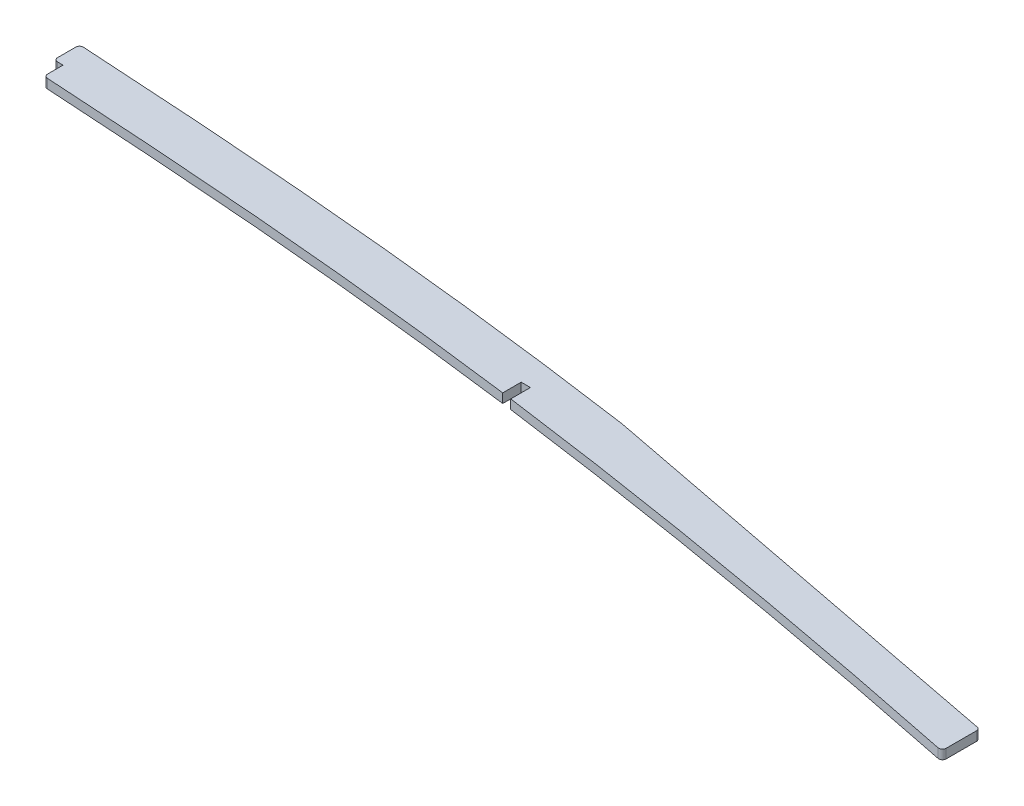
ISO-10303-21;
HEADER;
FILE_DESCRIPTION(('STEP AP214'),'2;1');
FILE_NAME('part.step','',(''),(''),'','','');
FILE_SCHEMA(('AUTOMOTIVE_DESIGN { 1 0 10303 214 1 1 1 1 }'));
ENDSEC;
DATA;
#1=APPLICATION_CONTEXT('core data for automotive mechanical design processes');
#2=APPLICATION_PROTOCOL_DEFINITION('international standard','automotive_design',2000,#1);
#3=PRODUCT_CONTEXT('',#1,'mechanical');
#4=PRODUCT('Part','Part','',(#3));
#5=PRODUCT_RELATED_PRODUCT_CATEGORY('part','',(#4));
#6=PRODUCT_DEFINITION_FORMATION('','',#4);
#7=PRODUCT_DEFINITION_CONTEXT('part definition',#1,'design');
#8=PRODUCT_DEFINITION('design','',#6,#7);
#9=PRODUCT_DEFINITION_SHAPE('','',#8);
#10=(LENGTH_UNIT() NAMED_UNIT(*) SI_UNIT(.MILLI.,.METRE.));
#11=(NAMED_UNIT(*) PLANE_ANGLE_UNIT() SI_UNIT($,.RADIAN.));
#12=(NAMED_UNIT(*) SI_UNIT($,.STERADIAN.) SOLID_ANGLE_UNIT());
#13=UNCERTAINTY_MEASURE_WITH_UNIT(LENGTH_MEASURE(1.E-05),#10,'distance_accuracy_value','');
#14=(GEOMETRIC_REPRESENTATION_CONTEXT(3) GLOBAL_UNCERTAINTY_ASSIGNED_CONTEXT((#13)) GLOBAL_UNIT_ASSIGNED_CONTEXT((#10,
#11,#12)) REPRESENTATION_CONTEXT('',''));
#15=CARTESIAN_POINT('',(0.,0.,0.));
#16=DIRECTION('',(0.,0.,1.));
#17=DIRECTION('',(1.,0.,0.));
#18=AXIS2_PLACEMENT_3D('',#15,#16,#17);
#19=CARTESIAN_POINT('',(2125.00064017427,1.5875,-94.4800369448474));
#20=CARTESIAN_POINT('',(2149.04351205278,1.5875,-93.497408198186));
#21=CARTESIAN_POINT('',(2173.08465693507,1.5875,-92.4714303186568));
#22=CARTESIAN_POINT('',(2221.16051111618,1.5875,-90.2825451342161));
#23=CARTESIAN_POINT('',(2245.19553408109,1.5875,-89.1196551679897));
#24=CARTESIAN_POINT('',(2281.23975724731,1.5875,-87.2213575710183));
#25=CARTESIAN_POINT('',(2293.25302693238,1.5875,-86.5622387735997));
#26=CARTESIAN_POINT('',(2317.27629287288,1.5875,-85.1853725215189));
#27=CARTESIAN_POINT('',(2329.28667496271,1.5875,-84.4695877060572));
#28=CARTESIAN_POINT('',(2353.30043194924,1.5875,-82.9360976908141));
#29=CARTESIAN_POINT('',(2365.30329886088,1.5875,-82.1167454790412));
#30=CARTESIAN_POINT('',(2389.29570022096,1.5875,-80.3032013832875));
#31=CARTESIAN_POINT('',(2401.28513168761,1.5875,-79.3076590137664));
#32=CARTESIAN_POINT('',(2425.248015539,1.5875,-77.1070272915958));
#33=CARTESIAN_POINT('',(2437.21939504412,1.5875,-75.9021262287262));
#34=CARTESIAN_POINT('',(2461.1350429249,1.5875,-73.2728607205226));
#35=CARTESIAN_POINT('',(2473.08021873022,1.5875,-71.848649743833));
#36=CARTESIAN_POINT('',(2496.94588972892,1.5875,-68.7864051538839));
#37=CARTESIAN_POINT('',(2508.86721006671,1.5875,-67.1484398221377));
#38=CARTESIAN_POINT('',(2532.67675150176,1.5875,-63.6755945009625));
#39=CARTESIAN_POINT('',(2544.56619473404,1.5875,-61.8407677680709));
#40=CARTESIAN_POINT('',(2568.31735906903,1.5875,-57.9931353056948));
#41=CARTESIAN_POINT('',(2580.17961126629,1.5875,-55.980432346589));
#42=CARTESIAN_POINT('',(2603.8765766664,1.5875,-51.794563265322));
#43=CARTESIAN_POINT('',(2615.71090980775,1.5875,-49.6216949956207));
#44=CARTESIAN_POINT('',(2639.35036015543,1.5875,-45.1250865007013));
#45=CARTESIAN_POINT('',(2651.15621950326,1.5875,-42.8015133301686));
#46=CARTESIAN_POINT('',(2674.73471693345,1.5875,-37.9973454558139));
#47=CARTESIAN_POINT('',(2686.50776170266,1.5875,-35.5172707099935));
#48=CARTESIAN_POINT('',(2698.26092171884,1.5875,-32.9414891543206));
#49=B_SPLINE_CURVE_WITH_KNOTS('',3,(#19,#20,#21,#22,#23,#24,#25,#26,#27,#28,#29,#30,#31,#32,#33,
#34,#35,#36,#37,#38,#39,#40,#41,#42,#43,#44,#45,#46,#47,#48),.UNSPECIFIED.,.F.,.F.,(4,2,2,2,2,2,
2,2,2,2,2,2,2,2,4),(0.,0.125,0.25,0.3125,0.375,0.4375,0.5,0.5625,0.625,0.6875,0.75,0.8125,0.875,
0.9375,1.),.UNSPECIFIED.);
#50=DIRECTION('',(0.,-1.,0.));
#51=VECTOR('',#50,1.);
#52=SURFACE_OF_LINEAR_EXTRUSION('',#49,#51);
#53=CARTESIAN_POINT('',(2312.74397465339,1.5875,-85.4413805531746));
#54=CARTESIAN_POINT('',(2322.26195370306,1.5875,-84.8860367578641));
#55=CARTESIAN_POINT('',(2331.77885363362,1.5875,-84.3104401345136));
#56=CARTESIAN_POINT('',(2353.30043194924,1.5875,-82.9360976908141));
#57=CARTESIAN_POINT('',(2365.30329886088,1.5875,-82.1167454790412));
#58=CARTESIAN_POINT('',(2389.29570022096,1.5875,-80.3032013832875));
#59=CARTESIAN_POINT('',(2401.28513168761,1.5875,-79.3076590137664));
#60=CARTESIAN_POINT('',(2425.248015539,1.5875,-77.1070272915958));
#61=CARTESIAN_POINT('',(2437.21939504412,1.5875,-75.9021262287262));
#62=CARTESIAN_POINT('',(2461.1350429249,1.5875,-73.2728607205226));
#63=CARTESIAN_POINT('',(2473.08021873022,1.5875,-71.848649743833));
#64=CARTESIAN_POINT('',(2495.73279615856,1.5875,-68.9420592405899));
#65=CARTESIAN_POINT('',(2506.44324518488,1.5875,-67.4803671494609));
#66=CARTESIAN_POINT('',(2517.14075146026,1.5875,-65.9385305900614));
#67=B_SPLINE_CURVE_WITH_KNOTS('',3,(#53,#54,#55,#56,#57,#58,#59,#60,#61,#62,#63,#64,#65,#66),
.UNSPECIFIED.,.F.,.F.,(4,2,2,2,2,2,4),(0.325472661214101,0.375,0.4375,0.5,0.5625,0.625,
0.681146242072855),.UNSPECIFIED.);
#68=CARTESIAN_POINT('',(2312.74398306396,1.5875,-85.4415247011197));
#69=VERTEX_POINT('',#68);
#70=CARTESIAN_POINT('',(2517.14074629758,1.5875,-65.9384947733818));
#71=VERTEX_POINT('',#70);
#72=EDGE_CURVE('E196',#69,#71,#67,.T.);
#73=ORIENTED_EDGE('',*,*,#72,.T.);
#74=DIRECTION('',(0.,-1.,0.));
#75=VECTOR('',#74,1.);
#76=CARTESIAN_POINT('',(2517.14,-0.0024999999999999,-65.9386388982431));
#77=LINE('',#76,#75);
#78=CARTESIAN_POINT('',(2517.14043307902,-1.58960583541235,-65.9385552624042));
#79=VERTEX_POINT('',#78);
#80=EDGE_CURVE('E331',#79,#71,#77,.F.);
#81=ORIENTED_EDGE('',*,*,#80,.F.);
#82=CARTESIAN_POINT('',(2517.14075336885,-1.5875,-65.9385303149748));
#83=CARTESIAN_POINT('',(2506.44324645882,-1.5875,-67.4803669756025));
#84=CARTESIAN_POINT('',(2495.73279679608,-1.5875,-68.9420591587886));
#85=CARTESIAN_POINT('',(2473.08021873022,-1.5875,-71.848649743833));
#86=CARTESIAN_POINT('',(2461.1350429249,-1.5875,-73.2728607205226));
#87=CARTESIAN_POINT('',(2437.21939504412,-1.5875,-75.9021262287262));
#88=CARTESIAN_POINT('',(2425.248015539,-1.5875,-77.1070272915958));
#89=CARTESIAN_POINT('',(2401.28513168761,-1.5875,-79.3076590137664));
#90=CARTESIAN_POINT('',(2389.29570022096,-1.5875,-80.3032013832875));
#91=CARTESIAN_POINT('',(2365.30329886088,-1.5875,-82.1167454790412));
#92=CARTESIAN_POINT('',(2353.30043194924,-1.5875,-82.9360976908141));
#93=CARTESIAN_POINT('',(2331.7788536325,-1.5875,-84.3104401345854));
#94=CARTESIAN_POINT('',(2322.2619537008,-1.5875,-84.8860367580003));
#95=CARTESIAN_POINT('',(2312.74397465001,-1.5875,-85.4413805533716));
#96=B_SPLINE_CURVE_WITH_KNOTS('',3,(#82,#83,#84,#85,#86,#87,#88,#89,#90,#91,#92,#93,#94,#95),
.UNSPECIFIED.,.F.,.F.,(4,2,2,2,2,2,4),(0.325472661208244,0.381618906620208,0.444118906620208,
0.506618906620208,0.569118906620208,0.631618906620208,0.681146245411964),.UNSPECIFIED.);
#97=CARTESIAN_POINT('',(2312.74398306217,-1.5875,-85.4415246869222));
#98=VERTEX_POINT('',#97);
#99=EDGE_CURVE('E165',#98,#79,#96,.F.);
#100=ORIENTED_EDGE('',*,*,#99,.F.);
#101=DIRECTION('',(0.,-1.,0.));
#102=VECTOR('',#101,1.);
#103=CARTESIAN_POINT('',(2312.74397464853,1.5875,-85.4413805534581));
#104=LINE('',#103,#102);
#105=EDGE_CURVE('E377',#69,#98,#104,.T.);
#106=ORIENTED_EDGE('',*,*,#105,.F.);
#107=EDGE_LOOP('',(#73,#81,#100,#106));
#108=FACE_BOUND('',#107,.T.);
#109=ADVANCED_FACE('F41',(#108),#52,.T.);
#110=CARTESIAN_POINT('',(2124.37830308858,1.5875,-79.252749052653));
#111=CARTESIAN_POINT('',(2148.39751193199,1.5875,-78.2710874108631));
#112=CARTESIAN_POINT('',(2196.44142591429,1.5875,-76.2202304627624));
#113=CARTESIAN_POINT('',(2256.43632671494,1.5875,-73.3193029777612));
#114=CARTESIAN_POINT('',(2304.39682766951,1.5875,-70.6868537158113));
#115=CARTESIAN_POINT('',(2340.34200336636,1.5875,-68.5440440460852));
#116=CARTESIAN_POINT('',(2376.16909953384,1.5875,-66.0999017724206));
#117=CARTESIAN_POINT('',(2423.79225447921,1.5875,-62.148433446528));
#118=CARTESIAN_POINT('',(2483.11730251875,1.5875,-55.6326510171635));
#119=CARTESIAN_POINT('',(2554.04445691108,1.5875,-45.2265308139822));
#120=CARTESIAN_POINT('',(2611.9061277636,1.5875,-34.9727556057638));
#121=CARTESIAN_POINT('',(2648.22954061154,1.5875,-27.8453657370829));
#122=CARTESIAN_POINT('',(2665.29052708524,1.5875,-24.3690973591681));
#123=CARTESIAN_POINT('',(2678.0413738897,1.5875,-21.7219433950603));
#124=CARTESIAN_POINT('',(2688.64049273064,1.5875,-19.4481755033962));
#125=CARTESIAN_POINT('',(2694.99840626553,1.5875,-18.0547973486536));
#126=B_SPLINE_CURVE_WITH_KNOTS('',3,(#110,#111,#112,#113,#114,#115,#116,#117,#118,#119,#120,
#121,#122,#123,#124,#125),.UNSPECIFIED.,.F.,.F.,(4,1,1,1,1,1,1,1,1,1,1,1,1,4),(0.,0.125,0.25,
0.3125,0.375,0.4375,0.5,0.625,0.75,0.875,0.931953524477232,0.943294603731027,0.965976762238616,
1.),.UNSPECIFIED.);
#127=DIRECTION('',(0.,-1.,0.));
#128=VECTOR('',#127,1.);
#129=SURFACE_OF_LINEAR_EXTRUSION('',#126,#128);
#130=CARTESIAN_POINT('',(2315.77027851908,-1.5875,-69.9981689116351));
#131=CARTESIAN_POINT('',(2323.96019254909,-1.5875,-69.5154701849957));
#132=CARTESIAN_POINT('',(2344.12135262642,-1.5875,-68.2862149647029));
#133=CARTESIAN_POINT('',(2376.16909953384,-1.5875,-66.0999017724206));
#134=CARTESIAN_POINT('',(2423.79225447921,-1.5875,-62.148433446528));
#135=CARTESIAN_POINT('',(2460.90329305909,-1.5875,-58.0724577650065));
#136=CARTESIAN_POINT('',(2486.09972739751,-1.5875,-54.8115871458127));
#137=CARTESIAN_POINT('',(2487.61258124876,-1.5875,-54.6140340984797));
#138=B_SPLINE_CURVE_WITH_KNOTS('',3,(#130,#131,#132,#133,#134,#135,#136,#137),.UNSPECIFIED.,.F.,
.F.,(4,1,1,1,1,4),(0.332279107493079,0.375,0.4375,0.5,0.625,0.632985717069855),.UNSPECIFIED.);
#139=CARTESIAN_POINT('',(2315.7703230098,-1.5875,-69.9989237825159));
#140=VERTEX_POINT('',#139);
#141=CARTESIAN_POINT('',(2487.61249997359,-1.58964788720698,-54.6136835370382));
#142=VERTEX_POINT('',#141);
#143=EDGE_CURVE('E258',#140,#142,#138,.T.);
#144=ORIENTED_EDGE('',*,*,#143,.T.);
#145=DIRECTION('',(0.,1.,0.));
#146=VECTOR('',#145,1.);
#147=CARTESIAN_POINT('',(2487.6125,-1.5925,-54.6140447081878));
#148=LINE('',#147,#146);
#149=CARTESIAN_POINT('',(2487.6125,1.5875,-54.6140447081878));
#150=VERTEX_POINT('',#149);
#151=EDGE_CURVE('E320',#142,#150,#148,.T.);
#152=ORIENTED_EDGE('',*,*,#151,.T.);
#153=CARTESIAN_POINT('',(2315.77027816457,1.5875,-69.9981689325292));
#154=VERTEX_POINT('',#153);
#155=EDGE_CURVE('E259',#154,#150,#126,.T.);
#156=ORIENTED_EDGE('',*,*,#155,.F.);
#157=DIRECTION('',(0.,-1.,0.));
#158=VECTOR('',#157,1.);
#159=CARTESIAN_POINT('',(2315.77027816457,-1.5875,-69.9981689325292));
#160=LINE('',#159,#158);
#161=EDGE_CURVE('E264',#140,#154,#160,.F.);
#162=ORIENTED_EDGE('',*,*,#161,.F.);
#163=EDGE_LOOP('',(#144,#152,#156,#162));
#164=FACE_BOUND('',#163,.T.);
#165=ADVANCED_FACE('F305',(#164),#129,.F.);
#166=CARTESIAN_POINT('',(2669.54,1.5875,-7.61745278554091E-11));
#167=DIRECTION('',(-1.,0.,0.));
#168=DIRECTION('',(0.,0.,-1.));
#169=AXIS2_PLACEMENT_3D('',#166,#167,#168);
#170=PLANE('',#169);
#171=DIRECTION('',(0.,0.,1.));
#172=VECTOR('',#171,1.);
#173=CARTESIAN_POINT('',(2669.54,-1.5875,-7.61745278554091E-11));
#174=LINE('',#173,#172);
#175=CARTESIAN_POINT('',(2669.54,-1.5875,-35.4589734963627));
#176=VERTEX_POINT('',#175);
#177=CARTESIAN_POINT('',(2669.54,-1.5875,-25.0443756031255));
#178=VERTEX_POINT('',#177);
#179=EDGE_CURVE('E397',#176,#178,#174,.T.);
#180=ORIENTED_EDGE('',*,*,#179,.F.);
#181=DIRECTION('',(0.,1.,0.));
#182=VECTOR('',#181,1.);
#183=CARTESIAN_POINT('',(2669.54,1.5875,-35.4589734963627));
#184=LINE('',#183,#182);
#185=CARTESIAN_POINT('',(2669.54,1.5875,-35.4589734963627));
#186=VERTEX_POINT('',#185);
#187=EDGE_CURVE('E360',#186,#176,#184,.F.);
#188=ORIENTED_EDGE('',*,*,#187,.F.);
#189=DIRECTION('',(0.,0.,1.));
#190=VECTOR('',#189,1.);
#191=CARTESIAN_POINT('',(2669.54,1.5875,-7.61745278554091E-11));
#192=LINE('',#191,#190);
#193=CARTESIAN_POINT('',(2669.54,1.5875,-25.0443756031255));
#194=VERTEX_POINT('',#193);
#195=EDGE_CURVE('E280',#186,#194,#192,.T.);
#196=ORIENTED_EDGE('',*,*,#195,.T.);
#197=DIRECTION('',(0.,1.,0.));
#198=VECTOR('',#197,1.);
#199=CARTESIAN_POINT('',(2669.54,1.5875,-25.0443756031255));
#200=LINE('',#199,#198);
#201=EDGE_CURVE('E364',#178,#194,#200,.T.);
#202=ORIENTED_EDGE('',*,*,#201,.F.);
#203=EDGE_LOOP('',(#180,#188,#196,#202));
#204=FACE_BOUND('',#203,.T.);
#205=ADVANCED_FACE('F307',(#204),#170,.F.);
#206=CARTESIAN_POINT('',(2490.78749999026,1.5875,-54.1968621651898));
#207=VERTEX_POINT('',#206);
#208=CARTESIAN_POINT('',(2668.01254575253,1.5875,-23.8007449061504));
#209=VERTEX_POINT('',#208);
#210=EDGE_CURVE('E278',#207,#209,#126,.T.);
#211=ORIENTED_EDGE('',*,*,#210,.F.);
#212=DIRECTION('',(0.,1.,0.));
#213=VECTOR('',#212,1.);
#214=CARTESIAN_POINT('',(2490.78749999026,-1.5925,-54.1968621651898));
#215=LINE('',#214,#213);
#216=CARTESIAN_POINT('',(2490.7874999778,-1.58962136670422,-54.1964701715005));
#217=VERTEX_POINT('',#216);
#218=EDGE_CURVE('E322',#217,#207,#215,.T.);
#219=ORIENTED_EDGE('',*,*,#218,.F.);
#220=CARTESIAN_POINT('',(2490.78758843823,-1.5875,-54.1968504717389));
#221=CARTESIAN_POINT('',(2511.89346831468,-1.5875,-51.4065025037802));
#222=CARTESIAN_POINT('',(2556.60294893084,-1.5875,-44.7731356448457));
#223=CARTESIAN_POINT('',(2611.9061277636,-1.5875,-34.9727556057638));
#224=CARTESIAN_POINT('',(2648.22954061154,-1.5875,-27.8453657370829));
#225=CARTESIAN_POINT('',(2662.65415415635,-1.5875,-24.9062726191806));
#226=CARTESIAN_POINT('',(2666.39648104322,-1.5875,-24.13529979018));
#227=CARTESIAN_POINT('',(2668.01254575334,-1.5875,-23.8007449059823));
#228=B_SPLINE_CURVE_WITH_KNOTS('',3,(#220,#221,#222,#223,#224,#225,#226,#227),.UNSPECIFIED.,.F.,
.F.,(4,1,1,1,1,4),(0.638572683457684,0.75,0.875,0.931953524477232,0.943294603731027,
0.951918450106819),.UNSPECIFIED.);
#229=CARTESIAN_POINT('',(2668.01254788894,-1.5875,-23.8007552219838));
#230=VERTEX_POINT('',#229);
#231=EDGE_CURVE('E358',#217,#230,#228,.T.);
#232=ORIENTED_EDGE('',*,*,#231,.T.);
#233=DIRECTION('',(0.,-1.,0.));
#234=VECTOR('',#233,1.);
#235=CARTESIAN_POINT('',(2668.01254575253,1.5875,-23.8007449061503));
#236=LINE('',#235,#234);
#237=EDGE_CURVE('E357',#209,#230,#236,.T.);
#238=ORIENTED_EDGE('',*,*,#237,.F.);
#239=EDGE_LOOP('',(#211,#219,#232,#238));
#240=FACE_BOUND('',#239,.T.);
#241=ADVANCED_FACE('F221',(#240),#129,.F.);
#242=CARTESIAN_POINT('',(0.,1.5875,0.));
#243=DIRECTION('',(0.,1.,0.));
#244=DIRECTION('',(0.,0.,-1.));
#245=AXIS2_PLACEMENT_3D('',#242,#243,#244);
#246=PLANE('',#245);
#247=ORIENTED_EDGE('',*,*,#155,.T.);
#248=DIRECTION('',(0.,0.,-1.));
#249=VECTOR('',#248,1.);
#250=CARTESIAN_POINT('',(2487.6125,1.5875,0.));
#251=LINE('',#250,#249);
#252=CARTESIAN_POINT('',(2487.6125,1.5875,-60.9640446821163));
#253=VERTEX_POINT('',#252);
#254=EDGE_CURVE('E335',#150,#253,#251,.T.);
#255=ORIENTED_EDGE('',*,*,#254,.T.);
#256=DIRECTION('',(1.,0.,0.));
#257=VECTOR('',#256,1.);
#258=CARTESIAN_POINT('',(0.,1.5875,-60.9640446821163));
#259=LINE('',#258,#257);
#260=CARTESIAN_POINT('',(2490.7875,1.5875,-60.9640446821163));
#261=VERTEX_POINT('',#260);
#262=EDGE_CURVE('E185',#253,#261,#259,.T.);
#263=ORIENTED_EDGE('',*,*,#262,.T.);
#264=DIRECTION('',(0.,0.,1.));
#265=VECTOR('',#264,1.);
#266=CARTESIAN_POINT('',(2490.7875,1.5875,1.6345529996214E-10));
#267=LINE('',#266,#265);
#268=EDGE_CURVE('E338',#261,#207,#267,.T.);
#269=ORIENTED_EDGE('',*,*,#268,.T.);
#270=ORIENTED_EDGE('',*,*,#210,.T.);
#271=CARTESIAN_POINT('',(2668.27,1.5875,-25.0443756031255));
#272=DIRECTION('',(0.,-1.,0.));
#273=DIRECTION('',(0.,0.,-1.));
#274=AXIS2_PLACEMENT_3D('',#271,#272,#273);
#275=CIRCLE('',#274,1.27);
#276=EDGE_CURVE('E390',#194,#209,#275,.T.);
#277=ORIENTED_EDGE('',*,*,#276,.F.);
#278=ORIENTED_EDGE('',*,*,#195,.F.);
#279=CARTESIAN_POINT('',(2668.27,1.5875,-35.4589734963626));
#280=DIRECTION('',(0.,-1.,0.));
#281=DIRECTION('',(0.,0.,-1.));
#282=AXIS2_PLACEMENT_3D('',#279,#280,#281);
#283=CIRCLE('',#282,1.27);
#284=CARTESIAN_POINT('',(2668.51081270154,1.5875,-36.7059334968343));
#285=VERTEX_POINT('',#284);
#286=EDGE_CURVE('E266',#285,#186,#283,.T.);
#287=ORIENTED_EDGE('',*,*,#286,.F.);
#288=DIRECTION('',(-0.981858268087982,0.,-0.189616300426069));
#289=VECTOR('',#288,1.);
#290=CARTESIAN_POINT('',(102.778324828958,1.5875,-532.199751744926));
#291=LINE('',#290,#289);
#292=EDGE_CURVE('E290',#285,#71,#291,.T.);
#293=ORIENTED_EDGE('',*,*,#292,.T.);
#294=ORIENTED_EDGE('',*,*,#72,.F.);
#295=CARTESIAN_POINT('',(2312.67,1.5875,-84.1735368125441));
#296=DIRECTION('',(0.,-1.,0.));
#297=DIRECTION('',(0.,0.,-1.));
#298=AXIS2_PLACEMENT_3D('',#295,#296,#297);
#299=CIRCLE('',#298,1.27);
#300=CARTESIAN_POINT('',(2311.4,1.5875,-84.1735368125441));
#301=VERTEX_POINT('',#300);
#302=EDGE_CURVE('E393',#301,#69,#299,.T.);
#303=ORIENTED_EDGE('',*,*,#302,.F.);
#304=DIRECTION('',(0.,0.,-1.));
#305=VECTOR('',#304,1.);
#306=CARTESIAN_POINT('',(2311.4,1.5875,-6.72412135142371E-11));
#307=LINE('',#306,#305);
#308=CARTESIAN_POINT('',(2311.4,1.5875,-77.8742072105905));
#309=VERTEX_POINT('',#308);
#310=EDGE_CURVE('E178',#309,#301,#307,.T.);
#311=ORIENTED_EDGE('',*,*,#310,.F.);
#312=CARTESIAN_POINT('',(2312.67,1.5875,-77.8742072105905));
#313=DIRECTION('',(0.,-1.,0.));
#314=DIRECTION('',(0.,0.,-1.));
#315=AXIS2_PLACEMENT_3D('',#312,#313,#314);
#316=CIRCLE('',#315,1.27);
#317=CARTESIAN_POINT('',(2312.67,1.5875,-76.6042072105905));
#318=VERTEX_POINT('',#317);
#319=EDGE_CURVE('E177',#318,#309,#316,.T.);
#320=ORIENTED_EDGE('',*,*,#319,.F.);
#321=DIRECTION('',(1.,0.,0.));
#322=VECTOR('',#321,1.);
#323=CARTESIAN_POINT('',(0.,1.5875,-76.6042072105905));
#324=LINE('',#323,#322);
#325=CARTESIAN_POINT('',(2314.575,1.5875,-76.6042072105905));
#326=VERTEX_POINT('',#325);
#327=EDGE_CURVE('E158',#318,#326,#324,.T.);
#328=ORIENTED_EDGE('',*,*,#327,.T.);
#329=DIRECTION('',(0.,0.,1.));
#330=VECTOR('',#329,1.);
#331=CARTESIAN_POINT('',(2314.575,1.5875,0.));
#332=LINE('',#331,#330);
#333=CARTESIAN_POINT('',(2314.575,1.5875,-71.2659688565353));
#334=VERTEX_POINT('',#333);
#335=EDGE_CURVE('E166',#326,#334,#332,.T.);
#336=ORIENTED_EDGE('',*,*,#335,.T.);
#337=CARTESIAN_POINT('',(2315.845,1.5875,-71.2659688565353));
#338=DIRECTION('',(0.,-1.,0.));
#339=DIRECTION('',(0.,0.,-1.));
#340=AXIS2_PLACEMENT_3D('',#337,#338,#339);
#341=CIRCLE('',#340,1.27);
#342=EDGE_CURVE('E389',#154,#334,#341,.T.);
#343=ORIENTED_EDGE('',*,*,#342,.F.);
#344=EDGE_LOOP('',(#247,#255,#263,#269,#270,#277,#278,#287,#293,#294,#303,#311,#320,#328,#336,#343));
#345=FACE_BOUND('',#344,.T.);
#346=ADVANCED_FACE('F175',(#345),#246,.T.);
#347=CARTESIAN_POINT('',(0.,-1.5875,0.));
#348=DIRECTION('',(0.,1.,0.));
#349=DIRECTION('',(0.,0.,-1.));
#350=AXIS2_PLACEMENT_3D('',#347,#348,#349);
#351=PLANE('',#350);
#352=DIRECTION('',(0.,0.,1.));
#353=VECTOR('',#352,1.);
#354=CARTESIAN_POINT('',(2314.575,-1.5875,0.));
#355=LINE('',#354,#353);
#356=CARTESIAN_POINT('',(2314.575,-1.5875,-76.6042072105905));
#357=VERTEX_POINT('',#356);
#358=CARTESIAN_POINT('',(2314.575,-1.5875,-71.2659688565353));
#359=VERTEX_POINT('',#358);
#360=EDGE_CURVE('E267',#357,#359,#355,.T.);
#361=ORIENTED_EDGE('',*,*,#360,.F.);
#362=DIRECTION('',(1.,0.,0.));
#363=VECTOR('',#362,1.);
#364=CARTESIAN_POINT('',(0.,-1.5875,-76.6042072105905));
#365=LINE('',#364,#363);
#366=CARTESIAN_POINT('',(2312.67,-1.5875,-76.6042072105905));
#367=VERTEX_POINT('',#366);
#368=EDGE_CURVE('E161',#367,#357,#365,.T.);
#369=ORIENTED_EDGE('',*,*,#368,.F.);
#370=CARTESIAN_POINT('',(2312.67,-1.5875,-77.8742072105905));
#371=DIRECTION('',(0.,-1.,0.));
#372=DIRECTION('',(0.,0.,-1.));
#373=AXIS2_PLACEMENT_3D('',#370,#371,#372);
#374=CIRCLE('',#373,1.27);
#375=CARTESIAN_POINT('',(2311.4,-1.5875,-77.8742072105905));
#376=VERTEX_POINT('',#375);
#377=EDGE_CURVE('E383',#376,#367,#374,.F.);
#378=ORIENTED_EDGE('',*,*,#377,.F.);
#379=DIRECTION('',(0.,0.,-1.));
#380=VECTOR('',#379,1.);
#381=CARTESIAN_POINT('',(2311.4,-1.5875,-6.72412135142371E-11));
#382=LINE('',#381,#380);
#383=CARTESIAN_POINT('',(2311.4,-1.5875,-84.1735368125441));
#384=VERTEX_POINT('',#383);
#385=EDGE_CURVE('E272',#376,#384,#382,.T.);
#386=ORIENTED_EDGE('',*,*,#385,.T.);
#387=CARTESIAN_POINT('',(2312.67,-1.5875,-84.1735368125441));
#388=DIRECTION('',(0.,-1.,0.));
#389=DIRECTION('',(0.,0.,-1.));
#390=AXIS2_PLACEMENT_3D('',#387,#388,#389);
#391=CIRCLE('',#390,1.27);
#392=EDGE_CURVE('E385',#98,#384,#391,.F.);
#393=ORIENTED_EDGE('',*,*,#392,.F.);
#394=ORIENTED_EDGE('',*,*,#99,.T.);
#395=DIRECTION('',(-0.981858268087982,0.,-0.189616300426069));
#396=VECTOR('',#395,1.);
#397=CARTESIAN_POINT('',(102.778324828958,-1.5875,-532.199751744926));
#398=LINE('',#397,#396);
#399=CARTESIAN_POINT('',(2668.51081270154,-1.5875,-36.7059334968345));
#400=VERTEX_POINT('',#399);
#401=EDGE_CURVE('E283',#400,#79,#398,.T.);
#402=ORIENTED_EDGE('',*,*,#401,.F.);
#403=CARTESIAN_POINT('',(2668.27,-1.5875,-35.4589734963626));
#404=DIRECTION('',(0.,-1.,0.));
#405=DIRECTION('',(0.,0.,-1.));
#406=AXIS2_PLACEMENT_3D('',#403,#404,#405);
#407=CIRCLE('',#406,1.27);
#408=EDGE_CURVE('E386',#176,#400,#407,.F.);
#409=ORIENTED_EDGE('',*,*,#408,.F.);
#410=ORIENTED_EDGE('',*,*,#179,.T.);
#411=CARTESIAN_POINT('',(2668.27,-1.5875,-25.0443756031255));
#412=DIRECTION('',(0.,-1.,0.));
#413=DIRECTION('',(0.,0.,-1.));
#414=AXIS2_PLACEMENT_3D('',#411,#412,#413);
#415=CIRCLE('',#414,1.27);
#416=EDGE_CURVE('E366',#230,#178,#415,.F.);
#417=ORIENTED_EDGE('',*,*,#416,.F.);
#418=ORIENTED_EDGE('',*,*,#231,.F.);
#419=DIRECTION('',(0.,0.,1.));
#420=VECTOR('',#419,1.);
#421=CARTESIAN_POINT('',(2490.7875,-1.5875,1.6345529996214E-10));
#422=LINE('',#421,#420);
#423=CARTESIAN_POINT('',(2490.7875,-1.5875,-60.9640446821163));
#424=VERTEX_POINT('',#423);
#425=EDGE_CURVE('E352',#424,#217,#422,.T.);
#426=ORIENTED_EDGE('',*,*,#425,.F.);
#427=DIRECTION('',(1.,0.,0.));
#428=VECTOR('',#427,1.);
#429=CARTESIAN_POINT('',(0.,-1.5875,-60.9640446821163));
#430=LINE('',#429,#428);
#431=CARTESIAN_POINT('',(2487.6125,-1.5875,-60.9640446821163));
#432=VERTEX_POINT('',#431);
#433=EDGE_CURVE('E347',#432,#424,#430,.T.);
#434=ORIENTED_EDGE('',*,*,#433,.F.);
#435=DIRECTION('',(0.,0.,-1.));
#436=VECTOR('',#435,1.);
#437=CARTESIAN_POINT('',(2487.6125,-1.5875,0.));
#438=LINE('',#437,#436);
#439=EDGE_CURVE('E409',#142,#432,#438,.T.);
#440=ORIENTED_EDGE('',*,*,#439,.F.);
#441=ORIENTED_EDGE('',*,*,#143,.F.);
#442=CARTESIAN_POINT('',(2315.845,-1.5875,-71.2659688565353));
#443=DIRECTION('',(0.,-1.,0.));
#444=DIRECTION('',(0.,0.,-1.));
#445=AXIS2_PLACEMENT_3D('',#442,#443,#444);
#446=CIRCLE('',#445,1.27);
#447=EDGE_CURVE('E361',#359,#140,#446,.F.);
#448=ORIENTED_EDGE('',*,*,#447,.F.);
#449=EDGE_LOOP('',(#361,#369,#378,#386,#393,#394,#402,#409,#410,#417,#418,#426,#434,#440,#441,#448));
#450=FACE_BOUND('',#449,.T.);
#451=ADVANCED_FACE('F220',(#450),#351,.F.);
#452=CARTESIAN_POINT('',(102.778324828958,-1.5925,-532.199751744926));
#453=DIRECTION('',(-0.189616300426069,0.,0.981858268087982));
#454=DIRECTION('',(-0.981858268087982,0.,-0.189616300426069));
#455=AXIS2_PLACEMENT_3D('',#452,#453,#454);
#456=PLANE('',#455);
#457=ORIENTED_EDGE('',*,*,#401,.T.);
#458=ORIENTED_EDGE('',*,*,#80,.T.);
#459=ORIENTED_EDGE('',*,*,#292,.F.);
#460=DIRECTION('',(0.,1.,0.));
#461=VECTOR('',#460,1.);
#462=CARTESIAN_POINT('',(2668.51081270154,-1.5925,-36.7059334968344));
#463=LINE('',#462,#461);
#464=EDGE_CURVE('E11',#400,#285,#463,.T.);
#465=ORIENTED_EDGE('',*,*,#464,.F.);
#466=EDGE_LOOP('',(#457,#458,#459,#465));
#467=FACE_BOUND('',#466,.T.);
#468=ADVANCED_FACE('F222',(#467),#456,.F.);
#469=CARTESIAN_POINT('',(0.,-1.5925,-60.9640446821163));
#470=DIRECTION('',(0.,0.,-1.));
#471=DIRECTION('',(1.,0.,0.));
#472=AXIS2_PLACEMENT_3D('',#469,#470,#471);
#473=PLANE('',#472);
#474=DIRECTION('',(0.,1.,0.));
#475=VECTOR('',#474,1.);
#476=CARTESIAN_POINT('',(2487.6125,-1.5925,-60.9640446821163));
#477=LINE('',#476,#475);
#478=EDGE_CURVE('E180',#432,#253,#477,.T.);
#479=ORIENTED_EDGE('',*,*,#478,.F.);
#480=ORIENTED_EDGE('',*,*,#433,.T.);
#481=DIRECTION('',(0.,1.,0.));
#482=VECTOR('',#481,1.);
#483=CARTESIAN_POINT('',(2490.7875,-1.5925,-60.9640446821163));
#484=LINE('',#483,#482);
#485=EDGE_CURVE('E326',#424,#261,#484,.T.);
#486=ORIENTED_EDGE('',*,*,#485,.T.);
#487=ORIENTED_EDGE('',*,*,#262,.F.);
#488=EDGE_LOOP('',(#479,#480,#486,#487));
#489=FACE_BOUND('',#488,.T.);
#490=ADVANCED_FACE('F343',(#489),#473,.F.);
#491=CARTESIAN_POINT('',(2487.6125,-1.5925,0.));
#492=DIRECTION('',(-1.,0.,0.));
#493=DIRECTION('',(0.,0.,-1.));
#494=AXIS2_PLACEMENT_3D('',#491,#492,#493);
#495=PLANE('',#494);
#496=ORIENTED_EDGE('',*,*,#151,.F.);
#497=ORIENTED_EDGE('',*,*,#439,.T.);
#498=ORIENTED_EDGE('',*,*,#478,.T.);
#499=ORIENTED_EDGE('',*,*,#254,.F.);
#500=EDGE_LOOP('',(#496,#497,#498,#499));
#501=FACE_BOUND('',#500,.T.);
#502=ADVANCED_FACE('F446',(#501),#495,.F.);
#503=CARTESIAN_POINT('',(2490.7875,-1.5925,1.6345529996214E-10));
#504=DIRECTION('',(1.,0.,0.));
#505=DIRECTION('',(0.,0.,1.));
#506=AXIS2_PLACEMENT_3D('',#503,#504,#505);
#507=PLANE('',#506);
#508=ORIENTED_EDGE('',*,*,#485,.F.);
#509=ORIENTED_EDGE('',*,*,#425,.T.);
#510=ORIENTED_EDGE('',*,*,#218,.T.);
#511=ORIENTED_EDGE('',*,*,#268,.F.);
#512=EDGE_LOOP('',(#508,#509,#510,#511));
#513=FACE_BOUND('',#512,.T.);
#514=ADVANCED_FACE('F350',(#513),#507,.F.);
#515=CARTESIAN_POINT('',(2314.575,-1.5925,0.));
#516=DIRECTION('',(1.,0.,0.));
#517=DIRECTION('',(0.,0.,1.));
#518=AXIS2_PLACEMENT_3D('',#515,#516,#517);
#519=PLANE('',#518);
#520=ORIENTED_EDGE('',*,*,#335,.F.);
#521=DIRECTION('',(0.,1.,0.));
#522=VECTOR('',#521,1.);
#523=CARTESIAN_POINT('',(2314.575,-1.5925,-76.6042072105905));
#524=LINE('',#523,#522);
#525=EDGE_CURVE('E154',#357,#326,#524,.T.);
#526=ORIENTED_EDGE('',*,*,#525,.F.);
#527=ORIENTED_EDGE('',*,*,#360,.T.);
#528=DIRECTION('',(0.,1.,0.));
#529=VECTOR('',#528,1.);
#530=CARTESIAN_POINT('',(2314.575,-1.5925,-71.2659688565353));
#531=LINE('',#530,#529);
#532=EDGE_CURVE('E170',#334,#359,#531,.F.);
#533=ORIENTED_EDGE('',*,*,#532,.F.);
#534=EDGE_LOOP('',(#520,#526,#527,#533));
#535=FACE_BOUND('',#534,.T.);
#536=ADVANCED_FACE('F169',(#535),#519,.F.);
#537=CARTESIAN_POINT('',(0.,-1.5925,-76.6042072105905));
#538=DIRECTION('',(0.,0.,-1.));
#539=DIRECTION('',(1.,0.,0.));
#540=AXIS2_PLACEMENT_3D('',#537,#538,#539);
#541=PLANE('',#540);
#542=ORIENTED_EDGE('',*,*,#368,.T.);
#543=ORIENTED_EDGE('',*,*,#525,.T.);
#544=ORIENTED_EDGE('',*,*,#327,.F.);
#545=DIRECTION('',(0.,1.,0.));
#546=VECTOR('',#545,1.);
#547=CARTESIAN_POINT('',(2312.67,1.5875,-76.6042072105905));
#548=LINE('',#547,#546);
#549=EDGE_CURVE('E49',#367,#318,#548,.T.);
#550=ORIENTED_EDGE('',*,*,#549,.F.);
#551=EDGE_LOOP('',(#542,#543,#544,#550));
#552=FACE_BOUND('',#551,.T.);
#553=ADVANCED_FACE('F156',(#552),#541,.F.);
#554=CARTESIAN_POINT('',(2311.4,-1.5925,-6.72412135142371E-11));
#555=DIRECTION('',(-1.,0.,0.));
#556=DIRECTION('',(0.,0.,-1.));
#557=AXIS2_PLACEMENT_3D('',#554,#555,#556);
#558=PLANE('',#557);
#559=ORIENTED_EDGE('',*,*,#385,.F.);
#560=DIRECTION('',(0.,1.,0.));
#561=VECTOR('',#560,1.);
#562=CARTESIAN_POINT('',(2311.4,-1.5875,-77.8742072105905));
#563=LINE('',#562,#561);
#564=EDGE_CURVE('E64',#309,#376,#563,.F.);
#565=ORIENTED_EDGE('',*,*,#564,.F.);
#566=ORIENTED_EDGE('',*,*,#310,.T.);
#567=DIRECTION('',(0.,1.,0.));
#568=VECTOR('',#567,1.);
#569=CARTESIAN_POINT('',(2311.4,1.5875,-84.1735368125441));
#570=LINE('',#569,#568);
#571=EDGE_CURVE('E56',#384,#301,#570,.T.);
#572=ORIENTED_EDGE('',*,*,#571,.F.);
#573=EDGE_LOOP('',(#559,#565,#566,#572));
#574=FACE_BOUND('',#573,.T.);
#575=ADVANCED_FACE('F436',(#574),#558,.T.);
#576=CARTESIAN_POINT('',(2315.845,-0.0024999999999999,-71.2659688565353));
#577=DIRECTION('',(0.,-1.,0.));
#578=DIRECTION('',(0.,0.,1.));
#579=AXIS2_PLACEMENT_3D('',#576,#577,#578);
#580=CYLINDRICAL_SURFACE('',#579,1.27);
#581=ORIENTED_EDGE('',*,*,#447,.T.);
#582=ORIENTED_EDGE('',*,*,#161,.T.);
#583=ORIENTED_EDGE('',*,*,#342,.T.);
#584=ORIENTED_EDGE('',*,*,#532,.T.);
#585=EDGE_LOOP('',(#581,#582,#583,#584));
#586=FACE_BOUND('',#585,.T.);
#587=ADVANCED_FACE('F308',(#586),#580,.T.);
#588=CARTESIAN_POINT('',(2668.27,0.,-25.0443756031255));
#589=DIRECTION('',(0.,-1.,0.));
#590=DIRECTION('',(0.,0.,1.));
#591=AXIS2_PLACEMENT_3D('',#588,#589,#590);
#592=CYLINDRICAL_SURFACE('',#591,1.27);
#593=ORIENTED_EDGE('',*,*,#276,.T.);
#594=ORIENTED_EDGE('',*,*,#237,.T.);
#595=ORIENTED_EDGE('',*,*,#416,.T.);
#596=ORIENTED_EDGE('',*,*,#201,.T.);
#597=EDGE_LOOP('',(#593,#594,#595,#596));
#598=FACE_BOUND('',#597,.T.);
#599=ADVANCED_FACE('F423',(#598),#592,.T.);
#600=CARTESIAN_POINT('',(2312.67,-0.0024999999999999,-84.1735368125441));
#601=DIRECTION('',(0.,-1.,0.));
#602=DIRECTION('',(0.,0.,1.));
#603=AXIS2_PLACEMENT_3D('',#600,#601,#602);
#604=CYLINDRICAL_SURFACE('',#603,1.27);
#605=ORIENTED_EDGE('',*,*,#392,.T.);
#606=ORIENTED_EDGE('',*,*,#571,.T.);
#607=ORIENTED_EDGE('',*,*,#302,.T.);
#608=ORIENTED_EDGE('',*,*,#105,.T.);
#609=EDGE_LOOP('',(#605,#606,#607,#608));
#610=FACE_BOUND('',#609,.T.);
#611=ADVANCED_FACE('F433',(#610),#604,.T.);
#612=CARTESIAN_POINT('',(2312.67,-1.5925,-77.8742072105905));
#613=DIRECTION('',(0.,-1.,0.));
#614=DIRECTION('',(0.,0.,1.));
#615=AXIS2_PLACEMENT_3D('',#612,#613,#614);
#616=CYLINDRICAL_SURFACE('',#615,1.27);
#617=ORIENTED_EDGE('',*,*,#377,.T.);
#618=ORIENTED_EDGE('',*,*,#549,.T.);
#619=ORIENTED_EDGE('',*,*,#319,.T.);
#620=ORIENTED_EDGE('',*,*,#564,.T.);
#621=EDGE_LOOP('',(#617,#618,#619,#620));
#622=FACE_BOUND('',#621,.T.);
#623=ADVANCED_FACE('F381',(#622),#616,.T.);
#624=CARTESIAN_POINT('',(2668.27,-1.5925,-35.4589734963626));
#625=DIRECTION('',(0.,1.,0.));
#626=DIRECTION('',(0.,0.,-1.));
#627=AXIS2_PLACEMENT_3D('',#624,#625,#626);
#628=CYLINDRICAL_SURFACE('',#627,1.27);
#629=ORIENTED_EDGE('',*,*,#408,.T.);
#630=ORIENTED_EDGE('',*,*,#464,.T.);
#631=ORIENTED_EDGE('',*,*,#286,.T.);
#632=ORIENTED_EDGE('',*,*,#187,.T.);
#633=EDGE_LOOP('',(#629,#630,#631,#632));
#634=FACE_BOUND('',#633,.T.);
#635=ADVANCED_FACE('F43',(#634),#628,.T.);
#636=CLOSED_SHELL('',(#109,#165,#205,#241,#346,#451,#468,#490,#502,#514,#536,#553,#575,#587,
#599,#611,#623,#635));
#637=MANIFOLD_SOLID_BREP('B2',#636);
#638=ADVANCED_BREP_SHAPE_REPRESENTATION('',(#18,#637),#14);
#639=SHAPE_DEFINITION_REPRESENTATION(#9,#638);
ENDSEC;
END-ISO-10303-21;
